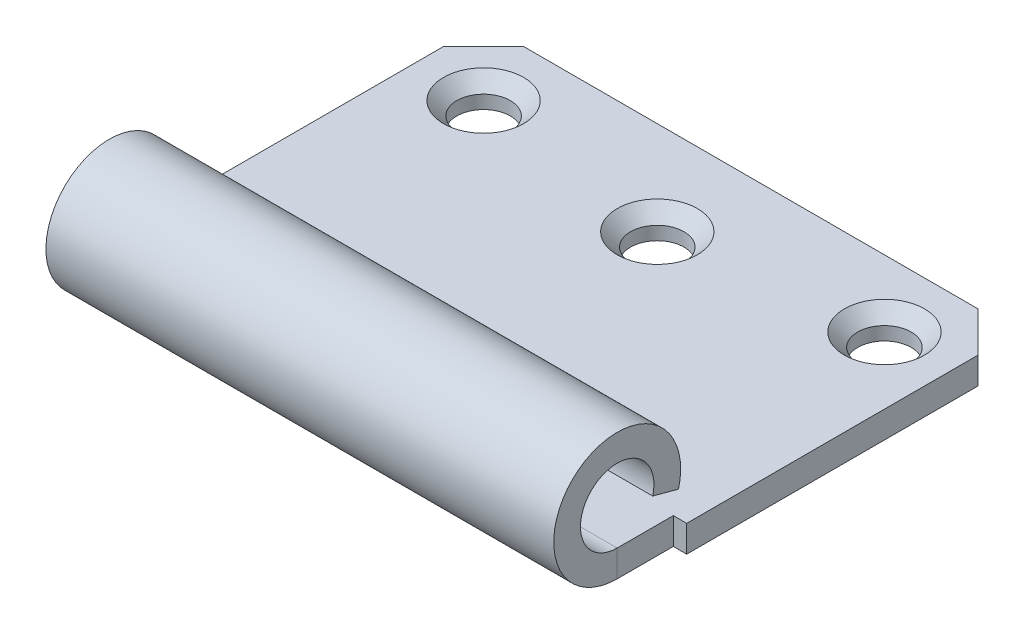
ISO-10303-21;
HEADER;
FILE_DESCRIPTION(('STEP AP214'),'2;1');
FILE_NAME('part.step','',(''),(''),'','','');
FILE_SCHEMA(('AUTOMOTIVE_DESIGN { 1 0 10303 214 1 1 1 1 }'));
ENDSEC;
DATA;
#1=APPLICATION_CONTEXT('core data for automotive mechanical design processes');
#2=APPLICATION_PROTOCOL_DEFINITION('international standard','automotive_design',2000,#1);
#3=PRODUCT_CONTEXT('',#1,'mechanical');
#4=PRODUCT('Part','Part','',(#3));
#5=PRODUCT_RELATED_PRODUCT_CATEGORY('part','',(#4));
#6=PRODUCT_DEFINITION_FORMATION('','',#4);
#7=PRODUCT_DEFINITION_CONTEXT('part definition',#1,'design');
#8=PRODUCT_DEFINITION('design','',#6,#7);
#9=PRODUCT_DEFINITION_SHAPE('','',#8);
#10=(LENGTH_UNIT() NAMED_UNIT(*) SI_UNIT(.MILLI.,.METRE.));
#11=(NAMED_UNIT(*) PLANE_ANGLE_UNIT() SI_UNIT($,.RADIAN.));
#12=(NAMED_UNIT(*) SI_UNIT($,.STERADIAN.) SOLID_ANGLE_UNIT());
#13=UNCERTAINTY_MEASURE_WITH_UNIT(LENGTH_MEASURE(1.E-05),#10,'distance_accuracy_value','');
#14=(GEOMETRIC_REPRESENTATION_CONTEXT(3) GLOBAL_UNCERTAINTY_ASSIGNED_CONTEXT((#13)) GLOBAL_UNIT_ASSIGNED_CONTEXT((#10,
#11,#12)) REPRESENTATION_CONTEXT('',''));
#15=CARTESIAN_POINT('',(0.,0.,0.));
#16=DIRECTION('',(0.,0.,1.));
#17=DIRECTION('',(1.,0.,0.));
#18=AXIS2_PLACEMENT_3D('',#15,#16,#17);
#19=CARTESIAN_POINT('',(20.,-2.,14.5));
#20=DIRECTION('',(1.,0.,0.));
#21=DIRECTION('',(0.,0.,-1.));
#22=AXIS2_PLACEMENT_3D('',#19,#20,#21);
#23=PLANE('',#22);
#24=DIRECTION('',(0.,1.,0.));
#25=VECTOR('',#24,1.);
#26=CARTESIAN_POINT('',(20.,-2.,10.3));
#27=LINE('',#26,#25);
#28=CARTESIAN_POINT('',(20.,-2.,10.3));
#29=VERTEX_POINT('',#28);
#30=CARTESIAN_POINT('',(20.,0.,10.3));
#31=VERTEX_POINT('',#30);
#32=EDGE_CURVE('E134',#29,#31,#27,.T.);
#33=ORIENTED_EDGE('',*,*,#32,.F.);
#34=DIRECTION('',(0.,0.,-1.));
#35=VECTOR('',#34,1.);
#36=CARTESIAN_POINT('',(20.,-2.,14.5));
#37=LINE('',#36,#35);
#38=CARTESIAN_POINT('',(20.,-2.,-11.5));
#39=VERTEX_POINT('',#38);
#40=EDGE_CURVE('E147',#29,#39,#37,.T.);
#41=ORIENTED_EDGE('',*,*,#40,.T.);
#42=DIRECTION('',(0.,1.,0.));
#43=VECTOR('',#42,1.);
#44=CARTESIAN_POINT('',(20.,-2.,-11.5));
#45=LINE('',#44,#43);
#46=CARTESIAN_POINT('',(20.,0.,-11.5));
#47=VERTEX_POINT('',#46);
#48=EDGE_CURVE('E182',#39,#47,#45,.T.);
#49=ORIENTED_EDGE('',*,*,#48,.T.);
#50=DIRECTION('',(0.,0.,-1.));
#51=VECTOR('',#50,1.);
#52=CARTESIAN_POINT('',(20.,0.,14.5));
#53=LINE('',#52,#51);
#54=EDGE_CURVE('E149',#31,#47,#53,.T.);
#55=ORIENTED_EDGE('',*,*,#54,.F.);
#56=EDGE_LOOP('',(#33,#41,#49,#55));
#57=FACE_BOUND('',#56,.T.);
#58=ADVANCED_FACE('F41',(#57),#23,.T.);
#59=CARTESIAN_POINT('',(-20.,-2.,14.5));
#60=DIRECTION('',(-1.,0.,0.));
#61=DIRECTION('',(0.,0.,1.));
#62=AXIS2_PLACEMENT_3D('',#59,#60,#61);
#63=PLANE('',#62);
#64=DIRECTION('',(0.,1.,0.));
#65=VECTOR('',#64,1.);
#66=CARTESIAN_POINT('',(-19.9999999999999,-2.,10.3000000000001));
#67=LINE('',#66,#65);
#68=CARTESIAN_POINT('',(-19.9999999999999,-2.,10.3000000000001));
#69=VERTEX_POINT('',#68);
#70=CARTESIAN_POINT('',(-19.9999999999999,0.,10.3000000000001));
#71=VERTEX_POINT('',#70);
#72=EDGE_CURVE('E328',#69,#71,#67,.T.);
#73=ORIENTED_EDGE('',*,*,#72,.T.);
#74=DIRECTION('',(0.,0.,1.));
#75=VECTOR('',#74,1.);
#76=CARTESIAN_POINT('',(-20.,0.,14.5));
#77=LINE('',#76,#75);
#78=CARTESIAN_POINT('',(-20.,0.,-11.5));
#79=VERTEX_POINT('',#78);
#80=EDGE_CURVE('E156',#79,#71,#77,.T.);
#81=ORIENTED_EDGE('',*,*,#80,.F.);
#82=DIRECTION('',(0.,-1.,0.));
#83=VECTOR('',#82,1.);
#84=CARTESIAN_POINT('',(-20.,-2.,-11.5));
#85=LINE('',#84,#83);
#86=CARTESIAN_POINT('',(-20.,-2.,-11.5));
#87=VERTEX_POINT('',#86);
#88=EDGE_CURVE('E177',#79,#87,#85,.T.);
#89=ORIENTED_EDGE('',*,*,#88,.T.);
#90=DIRECTION('',(0.,0.,1.));
#91=VECTOR('',#90,1.);
#92=CARTESIAN_POINT('',(-20.,-2.,14.5));
#93=LINE('',#92,#91);
#94=EDGE_CURVE('E158',#87,#69,#93,.T.);
#95=ORIENTED_EDGE('',*,*,#94,.T.);
#96=EDGE_LOOP('',(#73,#81,#89,#95));
#97=FACE_BOUND('',#96,.T.);
#98=ADVANCED_FACE('F219',(#97),#63,.T.);
#99=CARTESIAN_POINT('',(-20.,-2.,-14.5));
#100=DIRECTION('',(0.,0.,-1.));
#101=DIRECTION('',(-1.,0.,0.));
#102=AXIS2_PLACEMENT_3D('',#99,#100,#101);
#103=PLANE('',#102);
#104=DIRECTION('',(-1.,0.,0.));
#105=VECTOR('',#104,1.);
#106=CARTESIAN_POINT('',(-20.,0.,-14.5));
#107=LINE('',#106,#105);
#108=CARTESIAN_POINT('',(17.,0.,-14.5));
#109=VERTEX_POINT('',#108);
#110=CARTESIAN_POINT('',(-17.,0.,-14.5));
#111=VERTEX_POINT('',#110);
#112=EDGE_CURVE('E161',#109,#111,#107,.T.);
#113=ORIENTED_EDGE('',*,*,#112,.F.);
#114=DIRECTION('',(0.,-1.,0.));
#115=VECTOR('',#114,1.);
#116=CARTESIAN_POINT('',(17.,-2.,-14.5));
#117=LINE('',#116,#115);
#118=CARTESIAN_POINT('',(17.,-2.,-14.5));
#119=VERTEX_POINT('',#118);
#120=EDGE_CURVE('E57',#109,#119,#117,.T.);
#121=ORIENTED_EDGE('',*,*,#120,.T.);
#122=DIRECTION('',(-1.,0.,0.));
#123=VECTOR('',#122,1.);
#124=CARTESIAN_POINT('',(-20.,-2.,-14.5));
#125=LINE('',#124,#123);
#126=CARTESIAN_POINT('',(-17.,-2.,-14.5));
#127=VERTEX_POINT('',#126);
#128=EDGE_CURVE('E155',#119,#127,#125,.T.);
#129=ORIENTED_EDGE('',*,*,#128,.T.);
#130=DIRECTION('',(0.,1.,0.));
#131=VECTOR('',#130,1.);
#132=CARTESIAN_POINT('',(-17.,-2.,-14.5));
#133=LINE('',#132,#131);
#134=EDGE_CURVE('E169',#127,#111,#133,.T.);
#135=ORIENTED_EDGE('',*,*,#134,.T.);
#136=EDGE_LOOP('',(#113,#121,#129,#135));
#137=FACE_BOUND('',#136,.T.);
#138=ADVANCED_FACE('F224',(#137),#103,.T.);
#139=CARTESIAN_POINT('',(0.,-2.,0.));
#140=DIRECTION('',(0.,-1.,0.));
#141=DIRECTION('',(0.,0.,-1.));
#142=AXIS2_PLACEMENT_3D('',#139,#140,#141);
#143=PLANE('',#142);
#144=CARTESIAN_POINT('',(-15.,-2.,-9.5));
#145=DIRECTION('',(0.,1.,0.));
#146=DIRECTION('',(0.,0.,1.));
#147=AXIS2_PLACEMENT_3D('',#144,#145,#146);
#148=CIRCLE('',#147,2.);
#149=CARTESIAN_POINT('',(-15.,-2.,-7.5));
#150=VERTEX_POINT('',#149);
#151=EDGE_CURVE('E337',#150,#150,#148,.T.);
#152=ORIENTED_EDGE('',*,*,#151,.T.);
#153=EDGE_LOOP('',(#152));
#154=FACE_BOUND('',#153,.T.);
#155=CARTESIAN_POINT('',(0.,-2.,-7.5));
#156=DIRECTION('',(0.,1.,0.));
#157=DIRECTION('',(0.,0.,1.));
#158=AXIS2_PLACEMENT_3D('',#155,#156,#157);
#159=CIRCLE('',#158,2.);
#160=CARTESIAN_POINT('',(0.,-2.,-5.5));
#161=VERTEX_POINT('',#160);
#162=EDGE_CURVE('E349',#161,#161,#159,.T.);
#163=ORIENTED_EDGE('',*,*,#162,.T.);
#164=EDGE_LOOP('',(#163));
#165=FACE_BOUND('',#164,.T.);
#166=CARTESIAN_POINT('',(15.,-2.,-9.5));
#167=DIRECTION('',(0.,1.,0.));
#168=DIRECTION('',(0.,0.,1.));
#169=AXIS2_PLACEMENT_3D('',#166,#167,#168);
#170=CIRCLE('',#169,2.);
#171=CARTESIAN_POINT('',(15.,-2.,-7.5));
#172=VERTEX_POINT('',#171);
#173=EDGE_CURVE('E346',#172,#172,#170,.T.);
#174=ORIENTED_EDGE('',*,*,#173,.T.);
#175=EDGE_LOOP('',(#174));
#176=FACE_BOUND('',#175,.T.);
#177=DIRECTION('',(0.,0.,1.));
#178=VECTOR('',#177,1.);
#179=CARTESIAN_POINT('',(19.,-2.,14.5));
#180=LINE('',#179,#178);
#181=CARTESIAN_POINT('',(19.,-2.,10.3));
#182=VERTEX_POINT('',#181);
#183=CARTESIAN_POINT('',(19.,-2.,14.5));
#184=VERTEX_POINT('',#183);
#185=EDGE_CURVE('E141',#182,#184,#180,.T.);
#186=ORIENTED_EDGE('',*,*,#185,.T.);
#187=DIRECTION('',(1.,0.,0.));
#188=VECTOR('',#187,1.);
#189=CARTESIAN_POINT('',(19.,-2.,14.5));
#190=LINE('',#189,#188);
#191=CARTESIAN_POINT('',(-19.,-2.,14.5));
#192=VERTEX_POINT('',#191);
#193=EDGE_CURVE('E320',#184,#192,#190,.F.);
#194=ORIENTED_EDGE('',*,*,#193,.T.);
#195=DIRECTION('',(0.,0.,-1.));
#196=VECTOR('',#195,1.);
#197=CARTESIAN_POINT('',(-18.9999999999999,-2.,14.5000000000001));
#198=LINE('',#197,#196);
#199=CARTESIAN_POINT('',(-18.9999999999999,-2.,10.3000000000001));
#200=VERTEX_POINT('',#199);
#201=EDGE_CURVE('E335',#192,#200,#198,.T.);
#202=ORIENTED_EDGE('',*,*,#201,.T.);
#203=DIRECTION('',(-1.,0.,0.));
#204=VECTOR('',#203,1.);
#205=CARTESIAN_POINT('',(-19.9999999999999,-2.,10.3000000000001));
#206=LINE('',#205,#204);
#207=EDGE_CURVE('E329',#200,#69,#206,.T.);
#208=ORIENTED_EDGE('',*,*,#207,.T.);
#209=ORIENTED_EDGE('',*,*,#94,.F.);
#210=DIRECTION('',(-0.707106781186548,0.,0.707106781186548));
#211=VECTOR('',#210,1.);
#212=CARTESIAN_POINT('',(-15.75,-2.,-15.75));
#213=LINE('',#212,#211);
#214=EDGE_CURVE('E179',#87,#127,#213,.F.);
#215=ORIENTED_EDGE('',*,*,#214,.T.);
#216=ORIENTED_EDGE('',*,*,#128,.F.);
#217=DIRECTION('',(-0.707106781186548,0.,-0.707106781186547));
#218=VECTOR('',#217,1.);
#219=CARTESIAN_POINT('',(15.75,-2.,-15.75));
#220=LINE('',#219,#218);
#221=EDGE_CURVE('E153',#119,#39,#220,.F.);
#222=ORIENTED_EDGE('',*,*,#221,.T.);
#223=ORIENTED_EDGE('',*,*,#40,.F.);
#224=DIRECTION('',(-1.,0.,0.));
#225=VECTOR('',#224,1.);
#226=CARTESIAN_POINT('',(20.,-2.,10.3));
#227=LINE('',#226,#225);
#228=EDGE_CURVE('E130',#29,#182,#227,.T.);
#229=ORIENTED_EDGE('',*,*,#228,.T.);
#230=EDGE_LOOP('',(#186,#194,#202,#208,#209,#215,#216,#222,#223,#229));
#231=FACE_BOUND('',#230,.T.);
#232=ADVANCED_FACE('F151',(#154,#165,#176,#231),#143,.T.);
#233=CARTESIAN_POINT('',(0.,0.,0.));
#234=DIRECTION('',(0.,-1.,0.));
#235=DIRECTION('',(0.,0.,-1.));
#236=AXIS2_PLACEMENT_3D('',#233,#234,#235);
#237=PLANE('',#236);
#238=CARTESIAN_POINT('',(15.,0.,-9.5));
#239=DIRECTION('',(0.,-1.,0.));
#240=DIRECTION('',(0.,0.,-1.));
#241=AXIS2_PLACEMENT_3D('',#238,#239,#240);
#242=CIRCLE('',#241,3.00000000000001);
#243=CARTESIAN_POINT('',(15.,0.,-12.5));
#244=VERTEX_POINT('',#243);
#245=EDGE_CURVE('E196',#244,#244,#242,.T.);
#246=ORIENTED_EDGE('',*,*,#245,.T.);
#247=EDGE_LOOP('',(#246));
#248=FACE_BOUND('',#247,.T.);
#249=CARTESIAN_POINT('',(0.,0.,-7.5));
#250=DIRECTION('',(0.,-1.,0.));
#251=DIRECTION('',(0.,0.,-1.));
#252=AXIS2_PLACEMENT_3D('',#249,#250,#251);
#253=CIRCLE('',#252,3.00000000000002);
#254=CARTESIAN_POINT('',(0.,0.,-10.5));
#255=VERTEX_POINT('',#254);
#256=EDGE_CURVE('E193',#255,#255,#253,.T.);
#257=ORIENTED_EDGE('',*,*,#256,.T.);
#258=EDGE_LOOP('',(#257));
#259=FACE_BOUND('',#258,.T.);
#260=CARTESIAN_POINT('',(-15.,0.,-9.5));
#261=DIRECTION('',(0.,-1.,0.));
#262=DIRECTION('',(0.,0.,-1.));
#263=AXIS2_PLACEMENT_3D('',#260,#261,#262);
#264=CIRCLE('',#263,3.00000000000001);
#265=CARTESIAN_POINT('',(-15.,0.,-12.5));
#266=VERTEX_POINT('',#265);
#267=EDGE_CURVE('E190',#266,#266,#264,.T.);
#268=ORIENTED_EDGE('',*,*,#267,.T.);
#269=EDGE_LOOP('',(#268));
#270=FACE_BOUND('',#269,.T.);
#271=DIRECTION('',(1.,0.,0.));
#272=VECTOR('',#271,1.);
#273=CARTESIAN_POINT('',(19.,0.,14.5));
#274=LINE('',#273,#272);
#275=CARTESIAN_POINT('',(19.,0.,14.5));
#276=VERTEX_POINT('',#275);
#277=CARTESIAN_POINT('',(-18.9999999999999,0.,14.5000000000001));
#278=VERTEX_POINT('',#277);
#279=EDGE_CURVE('E284',#276,#278,#274,.F.);
#280=ORIENTED_EDGE('',*,*,#279,.F.);
#281=DIRECTION('',(0.,0.,1.));
#282=VECTOR('',#281,1.);
#283=CARTESIAN_POINT('',(19.,0.,14.5));
#284=LINE('',#283,#282);
#285=CARTESIAN_POINT('',(19.,0.,10.3));
#286=VERTEX_POINT('',#285);
#287=EDGE_CURVE('E142',#286,#276,#284,.T.);
#288=ORIENTED_EDGE('',*,*,#287,.F.);
#289=DIRECTION('',(-1.,0.,0.));
#290=VECTOR('',#289,1.);
#291=CARTESIAN_POINT('',(20.,0.,10.3));
#292=LINE('',#291,#290);
#293=EDGE_CURVE('E332',#31,#286,#292,.T.);
#294=ORIENTED_EDGE('',*,*,#293,.F.);
#295=ORIENTED_EDGE('',*,*,#54,.T.);
#296=DIRECTION('',(0.707106781186548,0.,0.707106781186547));
#297=VECTOR('',#296,1.);
#298=CARTESIAN_POINT('',(20.,0.,-11.5));
#299=LINE('',#298,#297);
#300=EDGE_CURVE('E65',#47,#109,#299,.F.);
#301=ORIENTED_EDGE('',*,*,#300,.T.);
#302=ORIENTED_EDGE('',*,*,#112,.T.);
#303=DIRECTION('',(0.707106781186548,0.,-0.707106781186548));
#304=VECTOR('',#303,1.);
#305=CARTESIAN_POINT('',(-17.,0.,-14.5));
#306=LINE('',#305,#304);
#307=EDGE_CURVE('E175',#111,#79,#306,.F.);
#308=ORIENTED_EDGE('',*,*,#307,.T.);
#309=ORIENTED_EDGE('',*,*,#80,.T.);
#310=DIRECTION('',(-1.,0.,0.));
#311=VECTOR('',#310,1.);
#312=CARTESIAN_POINT('',(-19.9999999999999,0.,10.3000000000001));
#313=LINE('',#312,#311);
#314=CARTESIAN_POINT('',(-18.9999999999999,0.,10.3000000000001));
#315=VERTEX_POINT('',#314);
#316=EDGE_CURVE('E333',#315,#71,#313,.T.);
#317=ORIENTED_EDGE('',*,*,#316,.F.);
#318=DIRECTION('',(0.,0.,-1.));
#319=VECTOR('',#318,1.);
#320=CARTESIAN_POINT('',(-18.9999999999999,0.,14.5000000000001));
#321=LINE('',#320,#319);
#322=EDGE_CURVE('E287',#278,#315,#321,.T.);
#323=ORIENTED_EDGE('',*,*,#322,.F.);
#324=EDGE_LOOP('',(#280,#288,#294,#295,#301,#302,#308,#309,#317,#323));
#325=FACE_BOUND('',#324,.T.);
#326=ADVANCED_FACE('F237',(#248,#259,#270,#325),#237,.F.);
#327=CARTESIAN_POINT('',(-17.,-2.,-14.5));
#328=DIRECTION('',(0.707106781186547,0.,0.707106781186547));
#329=DIRECTION('',(0.,1.,0.));
#330=AXIS2_PLACEMENT_3D('',#327,#328,#329);
#331=PLANE('',#330);
#332=ORIENTED_EDGE('',*,*,#214,.F.);
#333=ORIENTED_EDGE('',*,*,#88,.F.);
#334=ORIENTED_EDGE('',*,*,#307,.F.);
#335=ORIENTED_EDGE('',*,*,#134,.F.);
#336=EDGE_LOOP('',(#332,#333,#334,#335));
#337=FACE_BOUND('',#336,.T.);
#338=ADVANCED_FACE('F230',(#337),#331,.F.);
#339=CARTESIAN_POINT('',(20.,-2.,-11.5));
#340=DIRECTION('',(-0.707106781186547,0.,0.707106781186548));
#341=DIRECTION('',(0.,1.,0.));
#342=AXIS2_PLACEMENT_3D('',#339,#340,#341);
#343=PLANE('',#342);
#344=ORIENTED_EDGE('',*,*,#221,.F.);
#345=ORIENTED_EDGE('',*,*,#120,.F.);
#346=ORIENTED_EDGE('',*,*,#300,.F.);
#347=ORIENTED_EDGE('',*,*,#48,.F.);
#348=EDGE_LOOP('',(#344,#345,#346,#347));
#349=FACE_BOUND('',#348,.T.);
#350=ADVANCED_FACE('F236',(#349),#343,.F.);
#351=CARTESIAN_POINT('',(0.,2.03824762596804,11.8437039777051));
#352=DIRECTION('',(0.,0.965925826289066,-0.258819045102532));
#353=DIRECTION('',(1.,0.,0.));
#354=AXIS2_PLACEMENT_3D('',#351,#352,#353);
#355=PLANE('',#354);
#356=DIRECTION('',(0.,-0.258819045102532,-0.965925826289066));
#357=VECTOR('',#356,1.);
#358=CARTESIAN_POINT('',(19.,2.03824762596804,11.8437039777051));
#359=LINE('',#358,#357);
#360=CARTESIAN_POINT('',(19.,2.03824762596804,11.8437039777051));
#361=VERTEX_POINT('',#360);
#362=CARTESIAN_POINT('',(19.,1.52060953576298,9.91185232512694));
#363=VERTEX_POINT('',#362);
#364=EDGE_CURVE('E171',#361,#363,#359,.T.);
#365=ORIENTED_EDGE('',*,*,#364,.F.);
#366=DIRECTION('',(1.,0.,0.));
#367=VECTOR('',#366,1.);
#368=CARTESIAN_POINT('',(19.,2.03824762596804,11.8437039777051));
#369=LINE('',#368,#367);
#370=CARTESIAN_POINT('',(-19.,2.03824762596804,11.8437039777051));
#371=VERTEX_POINT('',#370);
#372=EDGE_CURVE('E297',#371,#361,#369,.T.);
#373=ORIENTED_EDGE('',*,*,#372,.F.);
#374=DIRECTION('',(0.,-0.258819045102532,-0.965925826289066));
#375=VECTOR('',#374,1.);
#376=CARTESIAN_POINT('',(-19.,2.03824762596804,11.8437039777051));
#377=LINE('',#376,#375);
#378=CARTESIAN_POINT('',(-19.,1.52060953576298,9.91185232512694));
#379=VERTEX_POINT('',#378);
#380=EDGE_CURVE('E306',#371,#379,#377,.T.);
#381=ORIENTED_EDGE('',*,*,#380,.T.);
#382=DIRECTION('',(1.,0.,0.));
#383=VECTOR('',#382,1.);
#384=CARTESIAN_POINT('',(19.,1.52060953576298,9.91185232512694));
#385=LINE('',#384,#383);
#386=EDGE_CURVE('E295',#379,#363,#385,.T.);
#387=ORIENTED_EDGE('',*,*,#386,.T.);
#388=EDGE_LOOP('',(#365,#373,#381,#387));
#389=FACE_BOUND('',#388,.T.);
#390=ADVANCED_FACE('F243',(#389),#355,.F.);
#391=CARTESIAN_POINT('',(-19.,2.75,14.5));
#392=DIRECTION('',(-1.,0.,0.));
#393=DIRECTION('',(0.,0.,1.));
#394=AXIS2_PLACEMENT_3D('',#391,#392,#393);
#395=PLANE('',#394);
#396=ORIENTED_EDGE('',*,*,#380,.F.);
#397=CARTESIAN_POINT('',(-19.,2.75,14.5));
#398=DIRECTION('',(1.,0.,0.));
#399=DIRECTION('',(0.,0.,-1.));
#400=AXIS2_PLACEMENT_3D('',#397,#398,#399);
#401=CIRCLE('',#400,2.75);
#402=EDGE_CURVE('E292',#278,#371,#401,.F.);
#403=ORIENTED_EDGE('',*,*,#402,.F.);
#404=DIRECTION('',(0.,-1.,0.));
#405=VECTOR('',#404,1.);
#406=CARTESIAN_POINT('',(-19.,0.,14.5));
#407=LINE('',#406,#405);
#408=EDGE_CURVE('E303',#278,#192,#407,.T.);
#409=ORIENTED_EDGE('',*,*,#408,.T.);
#410=CARTESIAN_POINT('',(-19.,2.75,14.5));
#411=DIRECTION('',(1.,0.,0.));
#412=DIRECTION('',(0.,0.,-1.));
#413=AXIS2_PLACEMENT_3D('',#410,#411,#412);
#414=CIRCLE('',#413,4.75);
#415=EDGE_CURVE('E323',#192,#379,#414,.F.);
#416=ORIENTED_EDGE('',*,*,#415,.T.);
#417=EDGE_LOOP('',(#396,#403,#409,#416));
#418=FACE_BOUND('',#417,.T.);
#419=ADVANCED_FACE('F254',(#418),#395,.T.);
#420=CARTESIAN_POINT('',(19.,2.75,14.5));
#421=DIRECTION('',(-1.,0.,0.));
#422=DIRECTION('',(0.,0.,1.));
#423=AXIS2_PLACEMENT_3D('',#420,#421,#422);
#424=PLANE('',#423);
#425=CARTESIAN_POINT('',(19.,2.75,14.5));
#426=DIRECTION('',(1.,0.,0.));
#427=DIRECTION('',(0.,0.,-1.));
#428=AXIS2_PLACEMENT_3D('',#425,#426,#427);
#429=CIRCLE('',#428,2.75);
#430=EDGE_CURVE('E293',#361,#276,#429,.T.);
#431=ORIENTED_EDGE('',*,*,#430,.F.);
#432=ORIENTED_EDGE('',*,*,#364,.T.);
#433=CARTESIAN_POINT('',(19.,2.75,14.5));
#434=DIRECTION('',(1.,0.,0.));
#435=DIRECTION('',(0.,0.,-1.));
#436=AXIS2_PLACEMENT_3D('',#433,#434,#435);
#437=CIRCLE('',#436,4.75);
#438=EDGE_CURVE('E311',#363,#184,#437,.T.);
#439=ORIENTED_EDGE('',*,*,#438,.T.);
#440=DIRECTION('',(0.,-1.,0.));
#441=VECTOR('',#440,1.);
#442=CARTESIAN_POINT('',(19.,0.,14.5));
#443=LINE('',#442,#441);
#444=EDGE_CURVE('E164',#276,#184,#443,.T.);
#445=ORIENTED_EDGE('',*,*,#444,.F.);
#446=EDGE_LOOP('',(#431,#432,#439,#445));
#447=FACE_BOUND('',#446,.T.);
#448=ADVANCED_FACE('F260',(#447),#424,.F.);
#449=CARTESIAN_POINT('',(19.,2.75,14.5));
#450=DIRECTION('',(1.,0.,0.));
#451=DIRECTION('',(0.,-0.258819045102531,-0.965925826289065));
#452=AXIS2_PLACEMENT_3D('',#449,#450,#451);
#453=CYLINDRICAL_SURFACE('',#452,4.75);
#454=ORIENTED_EDGE('',*,*,#193,.F.);
#455=ORIENTED_EDGE('',*,*,#438,.F.);
#456=ORIENTED_EDGE('',*,*,#386,.F.);
#457=ORIENTED_EDGE('',*,*,#415,.F.);
#458=EDGE_LOOP('',(#454,#455,#456,#457));
#459=FACE_BOUND('',#458,.T.);
#460=ADVANCED_FACE('F267',(#459),#453,.T.);
#461=CARTESIAN_POINT('',(19.,2.75,14.5));
#462=DIRECTION('',(1.,0.,0.));
#463=DIRECTION('',(0.,-0.258819045102531,-0.965925826289065));
#464=AXIS2_PLACEMENT_3D('',#461,#462,#463);
#465=CYLINDRICAL_SURFACE('',#464,2.75);
#466=ORIENTED_EDGE('',*,*,#279,.T.);
#467=ORIENTED_EDGE('',*,*,#402,.T.);
#468=ORIENTED_EDGE('',*,*,#372,.T.);
#469=ORIENTED_EDGE('',*,*,#430,.T.);
#470=EDGE_LOOP('',(#466,#467,#468,#469));
#471=FACE_BOUND('',#470,.T.);
#472=ADVANCED_FACE('F372',(#471),#465,.F.);
#473=CARTESIAN_POINT('',(19.,-2.,14.5));
#474=DIRECTION('',(-1.,0.,0.));
#475=DIRECTION('',(0.,0.,1.));
#476=AXIS2_PLACEMENT_3D('',#473,#474,#475);
#477=PLANE('',#476);
#478=ORIENTED_EDGE('',*,*,#287,.T.);
#479=ORIENTED_EDGE('',*,*,#444,.T.);
#480=ORIENTED_EDGE('',*,*,#185,.F.);
#481=DIRECTION('',(0.,1.,0.));
#482=VECTOR('',#481,1.);
#483=CARTESIAN_POINT('',(19.,-2.,10.3));
#484=LINE('',#483,#482);
#485=EDGE_CURVE('E136',#182,#286,#484,.T.);
#486=ORIENTED_EDGE('',*,*,#485,.T.);
#487=EDGE_LOOP('',(#478,#479,#480,#486));
#488=FACE_BOUND('',#487,.T.);
#489=ADVANCED_FACE('F369',(#488),#477,.F.);
#490=CARTESIAN_POINT('',(20.,-2.,10.3));
#491=DIRECTION('',(0.,0.,-1.));
#492=DIRECTION('',(-1.,0.,0.));
#493=AXIS2_PLACEMENT_3D('',#490,#491,#492);
#494=PLANE('',#493);
#495=ORIENTED_EDGE('',*,*,#293,.T.);
#496=ORIENTED_EDGE('',*,*,#485,.F.);
#497=ORIENTED_EDGE('',*,*,#228,.F.);
#498=ORIENTED_EDGE('',*,*,#32,.T.);
#499=EDGE_LOOP('',(#495,#496,#497,#498));
#500=FACE_BOUND('',#499,.T.);
#501=ADVANCED_FACE('F133',(#500),#494,.F.);
#502=CARTESIAN_POINT('',(-19.9999999999999,-2.,10.3000000000001));
#503=DIRECTION('',(0.,0.,-1.));
#504=DIRECTION('',(-1.,0.,0.));
#505=AXIS2_PLACEMENT_3D('',#502,#503,#504);
#506=PLANE('',#505);
#507=ORIENTED_EDGE('',*,*,#316,.T.);
#508=ORIENTED_EDGE('',*,*,#72,.F.);
#509=ORIENTED_EDGE('',*,*,#207,.F.);
#510=DIRECTION('',(0.,1.,0.));
#511=VECTOR('',#510,1.);
#512=CARTESIAN_POINT('',(-18.9999999999999,-2.,10.3000000000001));
#513=LINE('',#512,#511);
#514=EDGE_CURVE('E326',#200,#315,#513,.T.);
#515=ORIENTED_EDGE('',*,*,#514,.T.);
#516=EDGE_LOOP('',(#507,#508,#509,#515));
#517=FACE_BOUND('',#516,.T.);
#518=ADVANCED_FACE('F376',(#517),#506,.F.);
#519=CARTESIAN_POINT('',(-18.9999999999999,-2.,14.5000000000001));
#520=DIRECTION('',(1.,0.,0.));
#521=DIRECTION('',(0.,0.,-1.));
#522=AXIS2_PLACEMENT_3D('',#519,#520,#521);
#523=PLANE('',#522);
#524=ORIENTED_EDGE('',*,*,#322,.T.);
#525=ORIENTED_EDGE('',*,*,#514,.F.);
#526=ORIENTED_EDGE('',*,*,#201,.F.);
#527=ORIENTED_EDGE('',*,*,#408,.F.);
#528=EDGE_LOOP('',(#524,#525,#526,#527));
#529=FACE_BOUND('',#528,.T.);
#530=ADVANCED_FACE('F367',(#529),#523,.F.);
#531=CARTESIAN_POINT('',(15.,-2.,-9.5));
#532=DIRECTION('',(0.,1.,0.));
#533=DIRECTION('',(0.,0.,1.));
#534=AXIS2_PLACEMENT_3D('',#531,#532,#533);
#535=CYLINDRICAL_SURFACE('',#534,2.);
#536=CARTESIAN_POINT('',(15.,-1.,-9.5));
#537=DIRECTION('',(0.,-1.,0.));
#538=DIRECTION('',(0.,0.,-1.));
#539=AXIS2_PLACEMENT_3D('',#536,#537,#538);
#540=CIRCLE('',#539,2.);
#541=CARTESIAN_POINT('',(15.,-1.,-11.5));
#542=VERTEX_POINT('',#541);
#543=EDGE_CURVE('E187',#542,#542,#540,.F.);
#544=ORIENTED_EDGE('',*,*,#543,.T.);
#545=EDGE_LOOP('',(#544));
#546=FACE_BOUND('',#545,.T.);
#547=ORIENTED_EDGE('',*,*,#173,.F.);
#548=EDGE_LOOP('',(#547));
#549=FACE_BOUND('',#548,.T.);
#550=ADVANCED_FACE('F362',(#546,#549),#535,.F.);
#551=CARTESIAN_POINT('',(0.,-2.,-7.5));
#552=DIRECTION('',(0.,1.,0.));
#553=DIRECTION('',(0.,0.,1.));
#554=AXIS2_PLACEMENT_3D('',#551,#552,#553);
#555=CYLINDRICAL_SURFACE('',#554,2.);
#556=CARTESIAN_POINT('',(0.,-1.00000000000002,-7.5));
#557=DIRECTION('',(0.,-1.,0.));
#558=DIRECTION('',(0.,0.,-1.));
#559=AXIS2_PLACEMENT_3D('',#556,#557,#558);
#560=CIRCLE('',#559,2.);
#561=CARTESIAN_POINT('',(0.,-1.00000000000002,-9.5));
#562=VERTEX_POINT('',#561);
#563=EDGE_CURVE('E50',#562,#562,#560,.F.);
#564=ORIENTED_EDGE('',*,*,#563,.T.);
#565=EDGE_LOOP('',(#564));
#566=FACE_BOUND('',#565,.T.);
#567=ORIENTED_EDGE('',*,*,#162,.F.);
#568=EDGE_LOOP('',(#567));
#569=FACE_BOUND('',#568,.T.);
#570=ADVANCED_FACE('F201',(#566,#569),#555,.F.);
#571=CARTESIAN_POINT('',(-15.,-2.,-9.5));
#572=DIRECTION('',(0.,1.,0.));
#573=DIRECTION('',(0.,0.,1.));
#574=AXIS2_PLACEMENT_3D('',#571,#572,#573);
#575=CYLINDRICAL_SURFACE('',#574,2.);
#576=CARTESIAN_POINT('',(-15.,-1.,-9.5));
#577=DIRECTION('',(0.,-1.,0.));
#578=DIRECTION('',(0.,0.,-1.));
#579=AXIS2_PLACEMENT_3D('',#576,#577,#578);
#580=CIRCLE('',#579,2.);
#581=CARTESIAN_POINT('',(-15.,-1.,-11.5));
#582=VERTEX_POINT('',#581);
#583=EDGE_CURVE('E11',#582,#582,#580,.F.);
#584=ORIENTED_EDGE('',*,*,#583,.T.);
#585=EDGE_LOOP('',(#584));
#586=FACE_BOUND('',#585,.T.);
#587=ORIENTED_EDGE('',*,*,#151,.F.);
#588=EDGE_LOOP('',(#587));
#589=FACE_BOUND('',#588,.T.);
#590=ADVANCED_FACE('F213',(#586,#589),#575,.F.);
#591=CARTESIAN_POINT('',(15.,-1.,-9.5));
#592=DIRECTION('',(0.,1.,0.));
#593=DIRECTION('',(0.,0.,1.));
#594=AXIS2_PLACEMENT_3D('',#591,#592,#593);
#595=CONICAL_SURFACE('',#594,2.,0.785398163397452);
#596=ORIENTED_EDGE('',*,*,#245,.F.);
#597=EDGE_LOOP('',(#596));
#598=FACE_BOUND('',#597,.T.);
#599=ORIENTED_EDGE('',*,*,#543,.F.);
#600=EDGE_LOOP('',(#599));
#601=FACE_BOUND('',#600,.T.);
#602=ADVANCED_FACE('F206',(#598,#601),#595,.F.);
#603=CARTESIAN_POINT('',(0.,-1.00000000000002,-7.5));
#604=DIRECTION('',(0.,1.,0.));
#605=DIRECTION('',(0.,0.,1.));
#606=AXIS2_PLACEMENT_3D('',#603,#604,#605);
#607=CONICAL_SURFACE('',#606,2.,0.785398163397449);
#608=ORIENTED_EDGE('',*,*,#256,.F.);
#609=EDGE_LOOP('',(#608));
#610=FACE_BOUND('',#609,.T.);
#611=ORIENTED_EDGE('',*,*,#563,.F.);
#612=EDGE_LOOP('',(#611));
#613=FACE_BOUND('',#612,.T.);
#614=ADVANCED_FACE('F204',(#610,#613),#607,.F.);
#615=CARTESIAN_POINT('',(-15.,-1.,-9.5));
#616=DIRECTION('',(0.,1.,0.));
#617=DIRECTION('',(0.,0.,1.));
#618=AXIS2_PLACEMENT_3D('',#615,#616,#617);
#619=CONICAL_SURFACE('',#618,2.,0.785398163397452);
#620=ORIENTED_EDGE('',*,*,#267,.F.);
#621=EDGE_LOOP('',(#620));
#622=FACE_BOUND('',#621,.T.);
#623=ORIENTED_EDGE('',*,*,#583,.F.);
#624=EDGE_LOOP('',(#623));
#625=FACE_BOUND('',#624,.T.);
#626=ADVANCED_FACE('F44',(#622,#625),#619,.F.);
#627=CLOSED_SHELL('',(#58,#98,#138,#232,#326,#338,#350,#390,#419,#448,#460,#472,#489,#501,#518,
#530,#550,#570,#590,#602,#614,#626));
#628=MANIFOLD_SOLID_BREP('B2',#627);
#629=ADVANCED_BREP_SHAPE_REPRESENTATION('',(#18,#628),#14);
#630=SHAPE_DEFINITION_REPRESENTATION(#9,#629);
ENDSEC;
END-ISO-10303-21;
